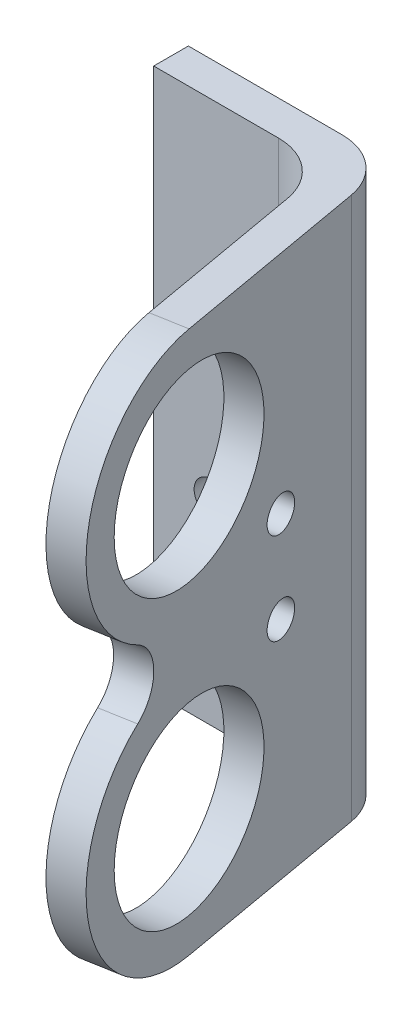
ISO-10303-21;
HEADER;
FILE_DESCRIPTION(('STEP AP214'),'2;1');
FILE_NAME('part.step','',(''),(''),'','','');
FILE_SCHEMA(('AUTOMOTIVE_DESIGN { 1 0 10303 214 1 1 1 1 }'));
ENDSEC;
DATA;
#1=APPLICATION_CONTEXT('core data for automotive mechanical design processes');
#2=APPLICATION_PROTOCOL_DEFINITION('international standard','automotive_design',2000,#1);
#3=PRODUCT_CONTEXT('',#1,'mechanical');
#4=PRODUCT('Part','Part','',(#3));
#5=PRODUCT_RELATED_PRODUCT_CATEGORY('part','',(#4));
#6=PRODUCT_DEFINITION_FORMATION('','',#4);
#7=PRODUCT_DEFINITION_CONTEXT('part definition',#1,'design');
#8=PRODUCT_DEFINITION('design','',#6,#7);
#9=PRODUCT_DEFINITION_SHAPE('','',#8);
#10=(LENGTH_UNIT() NAMED_UNIT(*) SI_UNIT(.MILLI.,.METRE.));
#11=(NAMED_UNIT(*) PLANE_ANGLE_UNIT() SI_UNIT($,.RADIAN.));
#12=(NAMED_UNIT(*) SI_UNIT($,.STERADIAN.) SOLID_ANGLE_UNIT());
#13=UNCERTAINTY_MEASURE_WITH_UNIT(LENGTH_MEASURE(1.E-05),#10,'distance_accuracy_value','');
#14=(GEOMETRIC_REPRESENTATION_CONTEXT(3) GLOBAL_UNCERTAINTY_ASSIGNED_CONTEXT((#13)) GLOBAL_UNIT_ASSIGNED_CONTEXT((#10,
#11,#12)) REPRESENTATION_CONTEXT('',''));
#15=CARTESIAN_POINT('',(0.,0.,0.));
#16=DIRECTION('',(0.,0.,1.));
#17=DIRECTION('',(1.,0.,0.));
#18=AXIS2_PLACEMENT_3D('',#15,#16,#17);
#19=CARTESIAN_POINT('',(17.8888455699224,47.,21.630774973123));
#20=DIRECTION('',(0.984807753012209,0.,-0.173648177666927));
#21=DIRECTION('',(-0.173648177666927,0.,-0.984807753012209));
#22=AXIS2_PLACEMENT_3D('',#19,#20,#21);
#23=PLANE('',#22);
#24=CARTESIAN_POINT('',(14.2761817374239,27.4635051930682,1.14234025948317));
#25=DIRECTION('',(-0.984807753012209,0.,0.173648177666927));
#26=DIRECTION('',(0.173648177666927,0.,0.984807753012209));
#27=AXIS2_PLACEMENT_3D('',#24,#25,#26);
#28=CIRCLE('',#27,1.47);
#29=CARTESIAN_POINT('',(14.5314445585943,27.4635051930682,2.59000765641112));
#30=VERTEX_POINT('',#29);
#31=EDGE_CURVE('E349',#30,#30,#28,.T.);
#32=ORIENTED_EDGE('',*,*,#31,.F.);
#33=EDGE_LOOP('',(#32));
#34=FACE_BOUND('',#33,.T.);
#35=CARTESIAN_POINT('',(14.2761817374239,19.5364948069318,1.14234025948317));
#36=DIRECTION('',(-0.984807753012209,0.,0.173648177666927));
#37=DIRECTION('',(0.173648177666927,0.,0.984807753012209));
#38=AXIS2_PLACEMENT_3D('',#35,#36,#37);
#39=CIRCLE('',#38,1.47);
#40=CARTESIAN_POINT('',(14.5314445585943,19.5364948069318,2.59000765641112));
#41=VERTEX_POINT('',#40);
#42=EDGE_CURVE('E356',#41,#41,#39,.T.);
#43=ORIENTED_EDGE('',*,*,#42,.F.);
#44=EDGE_LOOP('',(#43));
#45=FACE_BOUND('',#44,.T.);
#46=CARTESIAN_POINT('',(15.9787156155862,36.,10.7978896899887));
#47=DIRECTION('',(-0.984807753012209,0.,0.173648177666927));
#48=DIRECTION('',(0.173648177666927,0.,0.984807753012209));
#49=AXIS2_PLACEMENT_3D('',#46,#47,#48);
#50=CIRCLE('',#49,8.);
#51=CARTESIAN_POINT('',(17.3679010369217,36.,18.6763517140864));
#52=VERTEX_POINT('',#51);
#53=EDGE_CURVE('E243',#52,#52,#50,.T.);
#54=ORIENTED_EDGE('',*,*,#53,.F.);
#55=EDGE_LOOP('',(#54));
#56=FACE_BOUND('',#55,.T.);
#57=CARTESIAN_POINT('',(15.9787156155862,11.,10.7978896899887));
#58=DIRECTION('',(-0.984807753012209,0.,0.173648177666927));
#59=DIRECTION('',(0.173648177666927,0.,0.984807753012209));
#60=AXIS2_PLACEMENT_3D('',#57,#58,#59);
#61=CIRCLE('',#60,8.);
#62=CARTESIAN_POINT('',(17.3679010369217,11.,18.6763517140864));
#63=VERTEX_POINT('',#62);
#64=EDGE_CURVE('E232',#63,#63,#61,.T.);
#65=ORIENTED_EDGE('',*,*,#64,.F.);
#66=EDGE_LOOP('',(#65));
#67=FACE_BOUND('',#66,.T.);
#68=CARTESIAN_POINT('',(17.227766400431,23.5,17.8816086978581));
#69=DIRECTION('',(-0.984807753012209,0.,0.173648177666927));
#70=DIRECTION('',(0.173648177666927,0.,0.984807753012209));
#71=AXIS2_PLACEMENT_3D('',#68,#69,#70);
#72=CIRCLE('',#71,3.42183077301811);
#73=CARTESIAN_POINT('',(16.9314073264748,20.5341570820017,16.2008728696517));
#74=VERTEX_POINT('',#73);
#75=CARTESIAN_POINT('',(16.9314073264748,26.4658429179983,16.2008728696517));
#76=VERTEX_POINT('',#75);
#77=EDGE_CURVE('E229',#74,#76,#72,.F.);
#78=ORIENTED_EDGE('',*,*,#77,.T.);
#79=CARTESIAN_POINT('',(15.9787156155862,36.,10.7978896899887));
#80=DIRECTION('',(-0.984807753012209,0.,0.173648177666927));
#81=DIRECTION('',(0.173648177666927,0.,0.984807753012209));
#82=AXIS2_PLACEMENT_3D('',#79,#80,#81);
#83=CIRCLE('',#82,11.);
#84=CARTESIAN_POINT('',(15.9787156155862,47.,10.7978896899887));
#85=VERTEX_POINT('',#84);
#86=EDGE_CURVE('E213',#76,#85,#83,.T.);
#87=ORIENTED_EDGE('',*,*,#86,.T.);
#88=DIRECTION('',(0.173648177666927,0.,0.984807753012209));
#89=VECTOR('',#88,1.);
#90=CARTESIAN_POINT('',(17.8888455699224,47.,21.630774973123));
#91=LINE('',#90,#89);
#92=CARTESIAN_POINT('',(13.4079408490893,47.,-3.78169850557787));
#93=VERTEX_POINT('',#92);
#94=EDGE_CURVE('E284',#93,#85,#91,.T.);
#95=ORIENTED_EDGE('',*,*,#94,.F.);
#96=DIRECTION('',(0.,-1.,0.));
#97=VECTOR('',#96,1.);
#98=CARTESIAN_POINT('',(13.4079408490893,47.,-3.78169850557787));
#99=LINE('',#98,#97);
#100=CARTESIAN_POINT('',(13.4079408490893,0.,-3.78169850557787));
#101=VERTEX_POINT('',#100);
#102=EDGE_CURVE('E328',#93,#101,#99,.T.);
#103=ORIENTED_EDGE('',*,*,#102,.T.);
#104=DIRECTION('',(0.173648177666927,0.,0.984807753012209));
#105=VECTOR('',#104,1.);
#106=CARTESIAN_POINT('',(17.8888455699224,0.,21.630774973123));
#107=LINE('',#106,#105);
#108=CARTESIAN_POINT('',(15.9787156155862,0.,10.7978896899887));
#109=VERTEX_POINT('',#108);
#110=EDGE_CURVE('E306',#101,#109,#107,.T.);
#111=ORIENTED_EDGE('',*,*,#110,.T.);
#112=CARTESIAN_POINT('',(15.9787156155862,11.,10.7978896899887));
#113=DIRECTION('',(-0.984807753012209,0.,0.173648177666927));
#114=DIRECTION('',(0.173648177666927,0.,0.984807753012209));
#115=AXIS2_PLACEMENT_3D('',#112,#113,#114);
#116=CIRCLE('',#115,11.);
#117=EDGE_CURVE('E153',#109,#74,#116,.T.);
#118=ORIENTED_EDGE('',*,*,#117,.T.);
#119=EDGE_LOOP('',(#78,#87,#95,#103,#111,#118));
#120=FACE_BOUND('',#119,.T.);
#121=ADVANCED_FACE('F135',(#34,#45,#56,#67,#120),#23,.F.);
#122=CARTESIAN_POINT('',(15.9252397426211,47.,-6.78169850557787));
#123=DIRECTION('',(-0.984807753012208,0.,0.173648177666928));
#124=DIRECTION('',(0.173648177666928,0.,0.984807753012209));
#125=AXIS2_PLACEMENT_3D('',#122,#123,#124);
#126=PLANE('',#125);
#127=CARTESIAN_POINT('',(17.2306049964605,27.4635051930682,0.621395726482394));
#128=DIRECTION('',(-0.984807753012208,0.,0.173648177666928));
#129=DIRECTION('',(0.173648177666928,0.,0.984807753012209));
#130=AXIS2_PLACEMENT_3D('',#127,#128,#129);
#131=CIRCLE('',#130,1.47);
#132=CARTESIAN_POINT('',(17.4858678176309,27.4635051930682,2.06906312341034));
#133=VERTEX_POINT('',#132);
#134=EDGE_CURVE('E139',#133,#133,#131,.T.);
#135=ORIENTED_EDGE('',*,*,#134,.T.);
#136=EDGE_LOOP('',(#135));
#137=FACE_BOUND('',#136,.T.);
#138=CARTESIAN_POINT('',(17.2306049964605,19.5364948069318,0.621395726482394));
#139=DIRECTION('',(-0.984807753012208,0.,0.173648177666928));
#140=DIRECTION('',(0.173648177666928,0.,0.984807753012209));
#141=AXIS2_PLACEMENT_3D('',#138,#139,#140);
#142=CIRCLE('',#141,1.47);
#143=CARTESIAN_POINT('',(17.4858678176309,19.5364948069318,2.06906312341034));
#144=VERTEX_POINT('',#143);
#145=EDGE_CURVE('E346',#144,#144,#142,.T.);
#146=ORIENTED_EDGE('',*,*,#145,.T.);
#147=EDGE_LOOP('',(#146));
#148=FACE_BOUND('',#147,.T.);
#149=CARTESIAN_POINT('',(18.9331388746229,36.,10.2769451569879));
#150=DIRECTION('',(-0.984807753012208,0.,0.173648177666928));
#151=DIRECTION('',(0.173648177666928,0.,0.984807753012209));
#152=AXIS2_PLACEMENT_3D('',#149,#150,#151);
#153=CIRCLE('',#152,8.);
#154=CARTESIAN_POINT('',(20.3223242959583,36.,18.1554071810856));
#155=VERTEX_POINT('',#154);
#156=EDGE_CURVE('E237',#155,#155,#153,.T.);
#157=ORIENTED_EDGE('',*,*,#156,.T.);
#158=EDGE_LOOP('',(#157));
#159=FACE_BOUND('',#158,.T.);
#160=CARTESIAN_POINT('',(18.9331388746229,11.,10.2769451569879));
#161=DIRECTION('',(-0.984807753012208,0.,0.173648177666928));
#162=DIRECTION('',(0.173648177666928,0.,0.984807753012209));
#163=AXIS2_PLACEMENT_3D('',#160,#161,#162);
#164=CIRCLE('',#163,8.);
#165=CARTESIAN_POINT('',(20.3223242959583,11.,18.1554071810856));
#166=VERTEX_POINT('',#165);
#167=EDGE_CURVE('E223',#166,#166,#164,.T.);
#168=ORIENTED_EDGE('',*,*,#167,.T.);
#169=EDGE_LOOP('',(#168));
#170=FACE_BOUND('',#169,.T.);
#171=CARTESIAN_POINT('',(18.9331388746229,36.,10.2769451569879));
#172=DIRECTION('',(-0.984807753012208,0.,0.173648177666928));
#173=DIRECTION('',(0.173648177666928,0.,0.984807753012209));
#174=AXIS2_PLACEMENT_3D('',#171,#172,#173);
#175=CIRCLE('',#174,11.);
#176=CARTESIAN_POINT('',(19.8858305855114,26.4658429179983,15.679928336651));
#177=VERTEX_POINT('',#176);
#178=CARTESIAN_POINT('',(18.9331388746229,47.,10.2769451569879));
#179=VERTEX_POINT('',#178);
#180=EDGE_CURVE('E161',#177,#179,#175,.T.);
#181=ORIENTED_EDGE('',*,*,#180,.F.);
#182=CARTESIAN_POINT('',(20.1821896594676,23.5,17.3606641648573));
#183=DIRECTION('',(-0.984807753012208,0.,0.173648177666928));
#184=DIRECTION('',(0.173648177666928,0.,0.984807753012209));
#185=AXIS2_PLACEMENT_3D('',#182,#183,#184);
#186=CIRCLE('',#185,3.42183077301811);
#187=CARTESIAN_POINT('',(19.8858305855114,20.5341570820017,15.679928336651));
#188=VERTEX_POINT('',#187);
#189=EDGE_CURVE('E12',#188,#177,#186,.F.);
#190=ORIENTED_EDGE('',*,*,#189,.F.);
#191=CARTESIAN_POINT('',(18.9331388746229,11.,10.2769451569879));
#192=DIRECTION('',(-0.984807753012208,0.,0.173648177666928));
#193=DIRECTION('',(0.173648177666928,0.,0.984807753012209));
#194=AXIS2_PLACEMENT_3D('',#191,#192,#193);
#195=CIRCLE('',#194,11.);
#196=CARTESIAN_POINT('',(18.9331388746229,0.,10.2769451569879));
#197=VERTEX_POINT('',#196);
#198=EDGE_CURVE('E251',#197,#188,#195,.T.);
#199=ORIENTED_EDGE('',*,*,#198,.F.);
#200=DIRECTION('',(-0.173648177666928,0.,-0.984807753012209));
#201=VECTOR('',#200,1.);
#202=CARTESIAN_POINT('',(15.9252397426211,0.,-6.78169850557787));
#203=LINE('',#202,#201);
#204=CARTESIAN_POINT('',(15.9252397426211,0.,-6.78169850557787));
#205=VERTEX_POINT('',#204);
#206=EDGE_CURVE('E309',#197,#205,#203,.T.);
#207=ORIENTED_EDGE('',*,*,#206,.T.);
#208=DIRECTION('',(0.,-1.,0.));
#209=VECTOR('',#208,1.);
#210=CARTESIAN_POINT('',(15.9252397426211,47.,-6.78169850557787));
#211=LINE('',#210,#209);
#212=CARTESIAN_POINT('',(15.9252397426211,47.,-6.78169850557787));
#213=VERTEX_POINT('',#212);
#214=EDGE_CURVE('E324',#213,#205,#211,.T.);
#215=ORIENTED_EDGE('',*,*,#214,.F.);
#216=DIRECTION('',(-0.173648177666928,0.,-0.984807753012209));
#217=VECTOR('',#216,1.);
#218=CARTESIAN_POINT('',(15.9252397426211,47.,-6.78169850557787));
#219=LINE('',#218,#217);
#220=EDGE_CURVE('E287',#179,#213,#219,.T.);
#221=ORIENTED_EDGE('',*,*,#220,.F.);
#222=EDGE_LOOP('',(#181,#190,#199,#207,#215,#221));
#223=FACE_BOUND('',#222,.T.);
#224=ADVANCED_FACE('F373',(#137,#148,#159,#170,#223),#126,.F.);
#225=CARTESIAN_POINT('',(-2.32059976008538,47.,-7.91345761724326));
#226=DIRECTION('',(1.,0.,0.));
#227=DIRECTION('',(0.,0.,-1.));
#228=AXIS2_PLACEMENT_3D('',#225,#226,#227);
#229=PLANE('',#228);
#230=DIRECTION('',(0.,0.,1.));
#231=VECTOR('',#230,1.);
#232=CARTESIAN_POINT('',(-2.32059976008538,0.,-7.91345761724326));
#233=LINE('',#232,#231);
#234=CARTESIAN_POINT('',(-2.32059976008538,0.,-10.9134576172433));
#235=VERTEX_POINT('',#234);
#236=CARTESIAN_POINT('',(-2.32059976008538,0.,-7.91345761724326));
#237=VERTEX_POINT('',#236);
#238=EDGE_CURVE('E269',#235,#237,#233,.T.);
#239=ORIENTED_EDGE('',*,*,#238,.T.);
#240=DIRECTION('',(0.,-1.,0.));
#241=VECTOR('',#240,1.);
#242=CARTESIAN_POINT('',(-2.32059976008538,47.,-7.91345761724326));
#243=LINE('',#242,#241);
#244=CARTESIAN_POINT('',(-2.32059976008538,47.,-7.91345761724326));
#245=VERTEX_POINT('',#244);
#246=EDGE_CURVE('E336',#245,#237,#243,.T.);
#247=ORIENTED_EDGE('',*,*,#246,.F.);
#248=DIRECTION('',(0.,0.,1.));
#249=VECTOR('',#248,1.);
#250=CARTESIAN_POINT('',(-2.32059976008538,47.,-7.91345761724326));
#251=LINE('',#250,#249);
#252=CARTESIAN_POINT('',(-2.32059976008538,47.,-10.9134576172433));
#253=VERTEX_POINT('',#252);
#254=EDGE_CURVE('E273',#253,#245,#251,.T.);
#255=ORIENTED_EDGE('',*,*,#254,.F.);
#256=DIRECTION('',(0.,-1.,0.));
#257=VECTOR('',#256,1.);
#258=CARTESIAN_POINT('',(-2.32059976008538,47.,-10.9134576172433));
#259=LINE('',#258,#257);
#260=EDGE_CURVE('E296',#253,#235,#259,.T.);
#261=ORIENTED_EDGE('',*,*,#260,.T.);
#262=EDGE_LOOP('',(#239,#247,#255,#261));
#263=FACE_BOUND('',#262,.T.);
#264=ADVANCED_FACE('F137',(#263),#229,.F.);
#265=CARTESIAN_POINT('',(8.48390208402817,47.,-7.91345761724326));
#266=DIRECTION('',(0.,0.,-1.));
#267=DIRECTION('',(-1.,0.,0.));
#268=AXIS2_PLACEMENT_3D('',#265,#266,#267);
#269=PLANE('',#268);
#270=CARTESIAN_POINT('',(2.67940023991462,17.,-7.91345761724326));
#271=DIRECTION('',(0.,0.,1.));
#272=DIRECTION('',(1.,0.,0.));
#273=AXIS2_PLACEMENT_3D('',#270,#271,#272);
#274=CIRCLE('',#273,1.5);
#275=CARTESIAN_POINT('',(4.17940023991462,17.,-7.91345761724326));
#276=VERTEX_POINT('',#275);
#277=EDGE_CURVE('E256',#276,#276,#274,.T.);
#278=ORIENTED_EDGE('',*,*,#277,.F.);
#279=EDGE_LOOP('',(#278));
#280=FACE_BOUND('',#279,.T.);
#281=CARTESIAN_POINT('',(2.67940023991462,30.,-7.91345761724326));
#282=DIRECTION('',(0.,0.,1.));
#283=DIRECTION('',(1.,0.,0.));
#284=AXIS2_PLACEMENT_3D('',#281,#282,#283);
#285=CIRCLE('',#284,1.5);
#286=CARTESIAN_POINT('',(4.17940023991462,30.,-7.91345761724326));
#287=VERTEX_POINT('',#286);
#288=EDGE_CURVE('E261',#287,#287,#285,.T.);
#289=ORIENTED_EDGE('',*,*,#288,.F.);
#290=EDGE_LOOP('',(#289));
#291=FACE_BOUND('',#290,.T.);
#292=DIRECTION('',(1.,0.,0.));
#293=VECTOR('',#292,1.);
#294=CARTESIAN_POINT('',(8.48390208402817,0.,-7.91345761724326));
#295=LINE('',#294,#293);
#296=CARTESIAN_POINT('',(8.48390208402817,0.,-7.91345761724326));
#297=VERTEX_POINT('',#296);
#298=EDGE_CURVE('E300',#237,#297,#295,.T.);
#299=ORIENTED_EDGE('',*,*,#298,.T.);
#300=DIRECTION('',(0.,-1.,0.));
#301=VECTOR('',#300,1.);
#302=CARTESIAN_POINT('',(8.48390208402817,47.,-7.91345761724326));
#303=LINE('',#302,#301);
#304=CARTESIAN_POINT('',(8.48390208402817,47.,-7.91345761724326));
#305=VERTEX_POINT('',#304);
#306=EDGE_CURVE('E332',#305,#297,#303,.T.);
#307=ORIENTED_EDGE('',*,*,#306,.F.);
#308=DIRECTION('',(1.,0.,0.));
#309=VECTOR('',#308,1.);
#310=CARTESIAN_POINT('',(8.48390208402817,47.,-7.91345761724326));
#311=LINE('',#310,#309);
#312=EDGE_CURVE('E277',#245,#305,#311,.T.);
#313=ORIENTED_EDGE('',*,*,#312,.F.);
#314=ORIENTED_EDGE('',*,*,#246,.T.);
#315=EDGE_LOOP('',(#299,#307,#313,#314));
#316=FACE_BOUND('',#315,.T.);
#317=ADVANCED_FACE('F418',(#280,#291,#316),#269,.F.);
#318=CARTESIAN_POINT('',(8.4839020840282,47.,-2.91345761724326));
#319=DIRECTION('',(0.,-1.,0.));
#320=DIRECTION('',(0.,0.,-1.));
#321=AXIS2_PLACEMENT_3D('',#318,#319,#320);
#322=CYLINDRICAL_SURFACE('',#321,5.);
#323=CARTESIAN_POINT('',(8.4839020840282,0.,-2.91345761724326));
#324=DIRECTION('',(0.,-1.,0.));
#325=DIRECTION('',(0.,0.,1.));
#326=AXIS2_PLACEMENT_3D('',#323,#324,#325);
#327=CIRCLE('',#326,5.);
#328=EDGE_CURVE('E303',#297,#101,#327,.T.);
#329=ORIENTED_EDGE('',*,*,#328,.T.);
#330=ORIENTED_EDGE('',*,*,#102,.F.);
#331=CARTESIAN_POINT('',(8.4839020840282,47.,-2.91345761724326));
#332=DIRECTION('',(0.,-1.,0.));
#333=DIRECTION('',(0.,0.,1.));
#334=AXIS2_PLACEMENT_3D('',#331,#332,#333);
#335=CIRCLE('',#334,5.);
#336=EDGE_CURVE('E281',#305,#93,#335,.T.);
#337=ORIENTED_EDGE('',*,*,#336,.F.);
#338=ORIENTED_EDGE('',*,*,#306,.T.);
#339=EDGE_LOOP('',(#329,#330,#337,#338));
#340=FACE_BOUND('',#339,.T.);
#341=ADVANCED_FACE('F419',(#340),#322,.F.);
#342=CARTESIAN_POINT('',(11.00120097756,47.,-5.91345761724326));
#343=DIRECTION('',(0.,-1.,0.));
#344=DIRECTION('',(0.,0.,-1.));
#345=AXIS2_PLACEMENT_3D('',#342,#343,#344);
#346=CYLINDRICAL_SURFACE('',#345,5.);
#347=CARTESIAN_POINT('',(11.00120097756,0.,-5.91345761724326));
#348=DIRECTION('',(0.,1.,0.));
#349=DIRECTION('',(0.,0.,1.));
#350=AXIS2_PLACEMENT_3D('',#347,#348,#349);
#351=CIRCLE('',#350,5.);
#352=CARTESIAN_POINT('',(11.00120097756,0.,-10.9134576172433));
#353=VERTEX_POINT('',#352);
#354=EDGE_CURVE('E312',#205,#353,#351,.T.);
#355=ORIENTED_EDGE('',*,*,#354,.T.);
#356=DIRECTION('',(0.,-1.,0.));
#357=VECTOR('',#356,1.);
#358=CARTESIAN_POINT('',(11.00120097756,47.,-10.9134576172433));
#359=LINE('',#358,#357);
#360=CARTESIAN_POINT('',(11.00120097756,47.,-10.9134576172433));
#361=VERTEX_POINT('',#360);
#362=EDGE_CURVE('E320',#361,#353,#359,.T.);
#363=ORIENTED_EDGE('',*,*,#362,.F.);
#364=CARTESIAN_POINT('',(11.00120097756,47.,-5.91345761724326));
#365=DIRECTION('',(0.,1.,0.));
#366=DIRECTION('',(0.,0.,1.));
#367=AXIS2_PLACEMENT_3D('',#364,#365,#366);
#368=CIRCLE('',#367,5.);
#369=EDGE_CURVE('E290',#213,#361,#368,.T.);
#370=ORIENTED_EDGE('',*,*,#369,.F.);
#371=ORIENTED_EDGE('',*,*,#214,.T.);
#372=EDGE_LOOP('',(#355,#363,#370,#371));
#373=FACE_BOUND('',#372,.T.);
#374=ADVANCED_FACE('F406',(#373),#346,.T.);
#375=CARTESIAN_POINT('',(-2.32059976008538,47.,-10.9134576172433));
#376=DIRECTION('',(0.,0.,1.));
#377=DIRECTION('',(1.,0.,0.));
#378=AXIS2_PLACEMENT_3D('',#375,#376,#377);
#379=PLANE('',#378);
#380=CARTESIAN_POINT('',(2.67940023991462,17.,-10.9134576172433));
#381=DIRECTION('',(0.,0.,1.));
#382=DIRECTION('',(1.,0.,0.));
#383=AXIS2_PLACEMENT_3D('',#380,#381,#382);
#384=CIRCLE('',#383,1.5);
#385=CARTESIAN_POINT('',(4.17940023991462,17.,-10.9134576172433));
#386=VERTEX_POINT('',#385);
#387=EDGE_CURVE('E257',#386,#386,#384,.T.);
#388=ORIENTED_EDGE('',*,*,#387,.T.);
#389=EDGE_LOOP('',(#388));
#390=FACE_BOUND('',#389,.T.);
#391=CARTESIAN_POINT('',(2.67940023991462,30.,-10.9134576172433));
#392=DIRECTION('',(0.,0.,1.));
#393=DIRECTION('',(1.,0.,0.));
#394=AXIS2_PLACEMENT_3D('',#391,#392,#393);
#395=CIRCLE('',#394,1.5);
#396=CARTESIAN_POINT('',(4.17940023991462,30.,-10.9134576172433));
#397=VERTEX_POINT('',#396);
#398=EDGE_CURVE('E265',#397,#397,#395,.T.);
#399=ORIENTED_EDGE('',*,*,#398,.T.);
#400=EDGE_LOOP('',(#399));
#401=FACE_BOUND('',#400,.T.);
#402=DIRECTION('',(-1.,0.,0.));
#403=VECTOR('',#402,1.);
#404=CARTESIAN_POINT('',(-2.32059976008538,0.,-10.9134576172433));
#405=LINE('',#404,#403);
#406=EDGE_CURVE('E278',#353,#235,#405,.T.);
#407=ORIENTED_EDGE('',*,*,#406,.T.);
#408=ORIENTED_EDGE('',*,*,#260,.F.);
#409=DIRECTION('',(-1.,0.,0.));
#410=VECTOR('',#409,1.);
#411=CARTESIAN_POINT('',(-2.32059976008538,47.,-10.9134576172433));
#412=LINE('',#411,#410);
#413=EDGE_CURVE('E293',#361,#253,#412,.T.);
#414=ORIENTED_EDGE('',*,*,#413,.F.);
#415=ORIENTED_EDGE('',*,*,#362,.T.);
#416=EDGE_LOOP('',(#407,#408,#414,#415));
#417=FACE_BOUND('',#416,.T.);
#418=ADVANCED_FACE('F411',(#390,#401,#417),#379,.F.);
#419=CARTESIAN_POINT('',(11.00120097756,47.,-5.91345761724326));
#420=DIRECTION('',(0.,1.,0.));
#421=DIRECTION('',(0.,0.,1.));
#422=AXIS2_PLACEMENT_3D('',#419,#420,#421);
#423=PLANE('',#422);
#424=DIRECTION('',(-0.984807753012209,0.,0.173648177666927));
#425=VECTOR('',#424,1.);
#426=CARTESIAN_POINT('',(24.4094436601924,47.,9.31132486870913));
#427=LINE('',#426,#425);
#428=EDGE_CURVE('E217',#179,#85,#427,.T.);
#429=ORIENTED_EDGE('',*,*,#428,.F.);
#430=ORIENTED_EDGE('',*,*,#220,.T.);
#431=ORIENTED_EDGE('',*,*,#369,.T.);
#432=ORIENTED_EDGE('',*,*,#413,.T.);
#433=ORIENTED_EDGE('',*,*,#254,.T.);
#434=ORIENTED_EDGE('',*,*,#312,.T.);
#435=ORIENTED_EDGE('',*,*,#336,.T.);
#436=ORIENTED_EDGE('',*,*,#94,.T.);
#437=EDGE_LOOP('',(#429,#430,#431,#432,#433,#434,#435,#436));
#438=FACE_BOUND('',#437,.T.);
#439=ADVANCED_FACE('F394',(#438),#423,.T.);
#440=CARTESIAN_POINT('',(11.00120097756,0.,-5.91345761724326));
#441=DIRECTION('',(0.,1.,0.));
#442=DIRECTION('',(0.,0.,1.));
#443=AXIS2_PLACEMENT_3D('',#440,#441,#442);
#444=PLANE('',#443);
#445=ORIENTED_EDGE('',*,*,#206,.F.);
#446=DIRECTION('',(-0.984807753012209,0.,0.173648177666927));
#447=VECTOR('',#446,1.);
#448=CARTESIAN_POINT('',(24.4094436601924,0.,9.31132486870913));
#449=LINE('',#448,#447);
#450=EDGE_CURVE('E145',#197,#109,#449,.T.);
#451=ORIENTED_EDGE('',*,*,#450,.T.);
#452=ORIENTED_EDGE('',*,*,#110,.F.);
#453=ORIENTED_EDGE('',*,*,#328,.F.);
#454=ORIENTED_EDGE('',*,*,#298,.F.);
#455=ORIENTED_EDGE('',*,*,#238,.F.);
#456=ORIENTED_EDGE('',*,*,#406,.F.);
#457=ORIENTED_EDGE('',*,*,#354,.F.);
#458=EDGE_LOOP('',(#445,#451,#452,#453,#454,#455,#456,#457));
#459=FACE_BOUND('',#458,.T.);
#460=ADVANCED_FACE('F403',(#459),#444,.F.);
#461=CARTESIAN_POINT('',(2.67940023991462,30.,-10.9134576172433));
#462=DIRECTION('',(0.,0.,1.));
#463=DIRECTION('',(1.,0.,0.));
#464=AXIS2_PLACEMENT_3D('',#461,#462,#463);
#465=CYLINDRICAL_SURFACE('',#464,1.5);
#466=ORIENTED_EDGE('',*,*,#398,.F.);
#467=EDGE_LOOP('',(#466));
#468=FACE_BOUND('',#467,.T.);
#469=ORIENTED_EDGE('',*,*,#288,.T.);
#470=EDGE_LOOP('',(#469));
#471=FACE_BOUND('',#470,.T.);
#472=ADVANCED_FACE('F434',(#468,#471),#465,.F.);
#473=CARTESIAN_POINT('',(2.67940023991462,17.,-10.9134576172433));
#474=DIRECTION('',(0.,0.,1.));
#475=DIRECTION('',(1.,0.,0.));
#476=AXIS2_PLACEMENT_3D('',#473,#474,#475);
#477=CYLINDRICAL_SURFACE('',#476,1.5);
#478=ORIENTED_EDGE('',*,*,#387,.F.);
#479=EDGE_LOOP('',(#478));
#480=FACE_BOUND('',#479,.T.);
#481=ORIENTED_EDGE('',*,*,#277,.T.);
#482=EDGE_LOOP('',(#481));
#483=FACE_BOUND('',#482,.T.);
#484=ADVANCED_FACE('F439',(#480,#483),#477,.F.);
#485=CARTESIAN_POINT('',(24.4094436601924,36.,9.31132486870913));
#486=DIRECTION('',(-0.984807753012209,0.,0.173648177666927));
#487=DIRECTION('',(0.173648177666927,0.,0.984807753012209));
#488=AXIS2_PLACEMENT_3D('',#485,#486,#487);
#489=CYLINDRICAL_SURFACE('',#488,11.);
#490=ORIENTED_EDGE('',*,*,#180,.T.);
#491=ORIENTED_EDGE('',*,*,#428,.T.);
#492=ORIENTED_EDGE('',*,*,#86,.F.);
#493=DIRECTION('',(-0.984807753012209,0.,0.173648177666927));
#494=VECTOR('',#493,1.);
#495=CARTESIAN_POINT('',(25.362135371081,26.4658429179983,14.7143080483722));
#496=LINE('',#495,#494);
#497=EDGE_CURVE('E216',#177,#76,#496,.T.);
#498=ORIENTED_EDGE('',*,*,#497,.F.);
#499=EDGE_LOOP('',(#490,#491,#492,#498));
#500=FACE_BOUND('',#499,.T.);
#501=ADVANCED_FACE('F215',(#500),#489,.T.);
#502=CARTESIAN_POINT('',(24.4094436601924,11.,9.31132486870913));
#503=DIRECTION('',(-0.984807753012209,0.,0.173648177666927));
#504=DIRECTION('',(0.173648177666927,0.,0.984807753012209));
#505=AXIS2_PLACEMENT_3D('',#502,#503,#504);
#506=CYLINDRICAL_SURFACE('',#505,11.);
#507=ORIENTED_EDGE('',*,*,#198,.T.);
#508=DIRECTION('',(-0.984807753012209,0.,0.173648177666927));
#509=VECTOR('',#508,1.);
#510=CARTESIAN_POINT('',(25.362135371081,20.5341570820017,14.7143080483722));
#511=LINE('',#510,#509);
#512=EDGE_CURVE('E233',#188,#74,#511,.T.);
#513=ORIENTED_EDGE('',*,*,#512,.T.);
#514=ORIENTED_EDGE('',*,*,#117,.F.);
#515=ORIENTED_EDGE('',*,*,#450,.F.);
#516=EDGE_LOOP('',(#507,#513,#514,#515));
#517=FACE_BOUND('',#516,.T.);
#518=ADVANCED_FACE('F381',(#517),#506,.T.);
#519=CARTESIAN_POINT('',(24.4094436601924,11.,9.31132486870913));
#520=DIRECTION('',(-0.984807753012209,0.,0.173648177666927));
#521=DIRECTION('',(0.173648177666927,0.,0.984807753012209));
#522=AXIS2_PLACEMENT_3D('',#519,#520,#521);
#523=CYLINDRICAL_SURFACE('',#522,8.);
#524=ORIENTED_EDGE('',*,*,#64,.T.);
#525=EDGE_LOOP('',(#524));
#526=FACE_BOUND('',#525,.T.);
#527=ORIENTED_EDGE('',*,*,#167,.F.);
#528=EDGE_LOOP('',(#527));
#529=FACE_BOUND('',#528,.T.);
#530=ADVANCED_FACE('F378',(#526,#529),#523,.F.);
#531=CARTESIAN_POINT('',(25.6584944450372,23.5,16.3950438765786));
#532=DIRECTION('',(-0.984807753012209,0.,0.173648177666927));
#533=DIRECTION('',(0.173648177666927,0.,0.984807753012209));
#534=AXIS2_PLACEMENT_3D('',#531,#532,#533);
#535=CYLINDRICAL_SURFACE('',#534,3.42183077301811);
#536=ORIENTED_EDGE('',*,*,#189,.T.);
#537=ORIENTED_EDGE('',*,*,#497,.T.);
#538=ORIENTED_EDGE('',*,*,#77,.F.);
#539=ORIENTED_EDGE('',*,*,#512,.F.);
#540=EDGE_LOOP('',(#536,#537,#538,#539));
#541=FACE_BOUND('',#540,.T.);
#542=ADVANCED_FACE('F227',(#541),#535,.F.);
#543=CARTESIAN_POINT('',(24.4094436601924,36.,9.31132486870913));
#544=DIRECTION('',(-0.984807753012209,0.,0.173648177666927));
#545=DIRECTION('',(0.173648177666927,0.,0.984807753012209));
#546=AXIS2_PLACEMENT_3D('',#543,#544,#545);
#547=CYLINDRICAL_SURFACE('',#546,8.);
#548=ORIENTED_EDGE('',*,*,#53,.T.);
#549=EDGE_LOOP('',(#548));
#550=FACE_BOUND('',#549,.T.);
#551=ORIENTED_EDGE('',*,*,#156,.F.);
#552=EDGE_LOOP('',(#551));
#553=FACE_BOUND('',#552,.T.);
#554=ADVANCED_FACE('F368',(#550,#553),#547,.F.);
#555=CARTESIAN_POINT('',(22.7069097820301,19.5364948069318,-0.344224561796388));
#556=DIRECTION('',(-0.984807753012209,0.,0.173648177666927));
#557=DIRECTION('',(0.173648177666927,0.,0.984807753012209));
#558=AXIS2_PLACEMENT_3D('',#555,#556,#557);
#559=CYLINDRICAL_SURFACE('',#558,1.47);
#560=ORIENTED_EDGE('',*,*,#42,.T.);
#561=EDGE_LOOP('',(#560));
#562=FACE_BOUND('',#561,.T.);
#563=ORIENTED_EDGE('',*,*,#145,.F.);
#564=EDGE_LOOP('',(#563));
#565=FACE_BOUND('',#564,.T.);
#566=ADVANCED_FACE('F452',(#562,#565),#559,.F.);
#567=CARTESIAN_POINT('',(22.7069097820301,27.4635051930682,-0.344224561796388));
#568=DIRECTION('',(-0.984807753012209,0.,0.173648177666927));
#569=DIRECTION('',(0.173648177666927,0.,0.984807753012209));
#570=AXIS2_PLACEMENT_3D('',#567,#568,#569);
#571=CYLINDRICAL_SURFACE('',#570,1.47);
#572=ORIENTED_EDGE('',*,*,#31,.T.);
#573=EDGE_LOOP('',(#572));
#574=FACE_BOUND('',#573,.T.);
#575=ORIENTED_EDGE('',*,*,#134,.F.);
#576=EDGE_LOOP('',(#575));
#577=FACE_BOUND('',#576,.T.);
#578=ADVANCED_FACE('F455',(#574,#577),#571,.F.);
#579=CLOSED_SHELL('',(#121,#224,#264,#317,#341,#374,#418,#439,#460,#472,#484,#501,#518,#530,
#542,#554,#566,#578));
#580=MANIFOLD_SOLID_BREP('B2',#579);
#581=ADVANCED_BREP_SHAPE_REPRESENTATION('',(#18,#580),#14);
#582=SHAPE_DEFINITION_REPRESENTATION(#9,#581);
ENDSEC;
END-ISO-10303-21;
